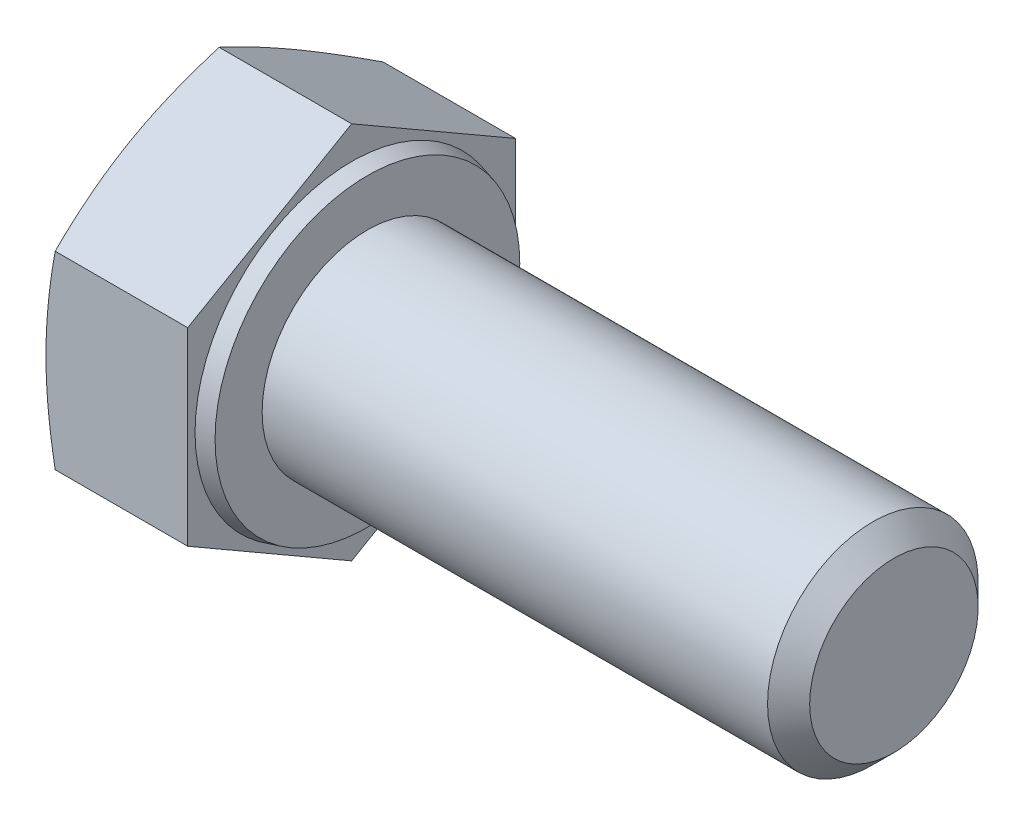
ISO-10303-21;
HEADER;
FILE_DESCRIPTION(('STEP AP214'),'2;1');
FILE_NAME('part.step','',(''),(''),'','','');
FILE_SCHEMA(('AUTOMOTIVE_DESIGN { 1 0 10303 214 1 1 1 1 }'));
ENDSEC;
DATA;
#1=APPLICATION_CONTEXT('core data for automotive mechanical design processes');
#2=APPLICATION_PROTOCOL_DEFINITION('international standard','automotive_design',2000,#1);
#3=PRODUCT_CONTEXT('',#1,'mechanical');
#4=PRODUCT('Part','Part','',(#3));
#5=PRODUCT_RELATED_PRODUCT_CATEGORY('part','',(#4));
#6=PRODUCT_DEFINITION_FORMATION('','',#4);
#7=PRODUCT_DEFINITION_CONTEXT('part definition',#1,'design');
#8=PRODUCT_DEFINITION('design','',#6,#7);
#9=PRODUCT_DEFINITION_SHAPE('','',#8);
#10=(LENGTH_UNIT() NAMED_UNIT(*) SI_UNIT(.MILLI.,.METRE.));
#11=(NAMED_UNIT(*) PLANE_ANGLE_UNIT() SI_UNIT($,.RADIAN.));
#12=(NAMED_UNIT(*) SI_UNIT($,.STERADIAN.) SOLID_ANGLE_UNIT());
#13=UNCERTAINTY_MEASURE_WITH_UNIT(LENGTH_MEASURE(1.E-05),#10,'distance_accuracy_value','');
#14=(GEOMETRIC_REPRESENTATION_CONTEXT(3) GLOBAL_UNCERTAINTY_ASSIGNED_CONTEXT((#13)) GLOBAL_UNIT_ASSIGNED_CONTEXT((#10,
#11,#12)) REPRESENTATION_CONTEXT('',''));
#15=CARTESIAN_POINT('',(0.,0.,0.));
#16=DIRECTION('',(0.,0.,1.));
#17=DIRECTION('',(1.,0.,0.));
#18=AXIS2_PLACEMENT_3D('',#15,#16,#17);
#19=CARTESIAN_POINT('',(20.6,-3.595,-6.22672265321011));
#20=DIRECTION('',(0.,-0.866025403784439,-0.5));
#21=DIRECTION('',(0.,0.5,-0.866025403784439));
#22=AXIS2_PLACEMENT_3D('',#19,#20,#21);
#23=PLANE('',#22);
#24=DIRECTION('',(-1.,0.,0.));
#25=VECTOR('',#24,1.);
#26=CARTESIAN_POINT('',(20.6,-7.19,0.));
#27=LINE('',#26,#25);
#28=CARTESIAN_POINT('',(0.,-7.19,0.));
#29=VERTEX_POINT('',#28);
#30=CARTESIAN_POINT('',(-5.03389102967511,-7.19,0.));
#31=VERTEX_POINT('',#30);
#32=EDGE_CURVE('E58',#29,#31,#27,.T.);
#33=ORIENTED_EDGE('',*,*,#32,.T.);
#34=CARTESIAN_POINT('',(-5.03384900100014,-7.19011547005384,0.0002));
#35=CARTESIAN_POINT('',(-5.08805963076519,-7.04122910407722,-0.257678750425791));
#36=CARTESIAN_POINT('',(-5.13737359308155,-6.89185177286806,-0.516407877579102));
#37=CARTESIAN_POINT('',(-5.22413389520894,-6.59212583670845,-1.0355484273537));
#38=CARTESIAN_POINT('',(-5.26157094835133,-6.44177656505055,-1.29596100474615));
#39=CARTESIAN_POINT('',(-5.32212431475841,-6.14177529234696,-1.81557845140411));
#40=CARTESIAN_POINT('',(-5.34537270513493,-5.99213014273963,-2.07477145363024));
#41=CARTESIAN_POINT('',(-5.37655533214507,-5.69248989384581,-2.59376358870692));
#42=CARTESIAN_POINT('',(-5.38449531124956,-5.54249494692291,-2.85356245765599));
#43=CARTESIAN_POINT('',(-5.38449531124956,-5.2425050530771,-3.37316019555412));
#44=CARTESIAN_POINT('',(-5.37655533214507,-5.09251010615419,-3.63295906450319));
#45=CARTESIAN_POINT('',(-5.34537270513493,-4.79286985726037,-4.15195119957987));
#46=CARTESIAN_POINT('',(-5.32212431475841,-4.64322470765305,-4.41114420180601));
#47=CARTESIAN_POINT('',(-5.26157094835133,-4.34322343494945,-4.93076164846397));
#48=CARTESIAN_POINT('',(-5.22413389520894,-4.19287416329156,-5.19117422585641));
#49=CARTESIAN_POINT('',(-5.13737359308155,-3.89314822713194,-5.71031477563101));
#50=CARTESIAN_POINT('',(-5.08805963076518,-3.74377089592278,-5.96904390278432));
#51=CARTESIAN_POINT('',(-5.03384900100014,-3.59488452994616,-6.22692265321011));
#52=B_SPLINE_CURVE_WITH_KNOTS('',3,(#34,#35,#36,#37,#38,#39,#40,#41,#42,#43,#44,#45,#46,#47,#48,
#49,#50,#51),.UNSPECIFIED.,.F.,.F.,(4,2,2,2,2,2,2,2,4),(0.,0.908095057252449,1.81689842260343,
2.71710763162562,3.61697908961632,4.51685054760702,5.41705975662921,6.32586312198019,
7.23395817923264),.UNSPECIFIED.);
#53=CARTESIAN_POINT('',(-5.03389102967511,-3.595,-6.22672265321011));
#54=VERTEX_POINT('',#53);
#55=EDGE_CURVE('E51',#31,#54,#52,.T.);
#56=ORIENTED_EDGE('',*,*,#55,.T.);
#57=DIRECTION('',(-1.,0.,0.));
#58=VECTOR('',#57,1.);
#59=CARTESIAN_POINT('',(20.6,-3.595,-6.22672265321011));
#60=LINE('',#59,#58);
#61=CARTESIAN_POINT('',(0.,-3.595,-6.22672265321011));
#62=VERTEX_POINT('',#61);
#63=EDGE_CURVE('E124',#62,#54,#60,.T.);
#64=ORIENTED_EDGE('',*,*,#63,.F.);
#65=DIRECTION('',(0.,-0.5,0.866025403784439));
#66=VECTOR('',#65,1.);
#67=CARTESIAN_POINT('',(0.,-3.595,-6.22672265321011));
#68=LINE('',#67,#66);
#69=EDGE_CURVE('E139',#62,#29,#68,.T.);
#70=ORIENTED_EDGE('',*,*,#69,.T.);
#71=EDGE_LOOP('',(#33,#56,#64,#70));
#72=FACE_BOUND('',#71,.T.);
#73=ADVANCED_FACE('F36',(#72),#23,.T.);
#74=CARTESIAN_POINT('',(20.6,3.595,-6.22672265321011));
#75=DIRECTION('',(0.,0.,-1.));
#76=DIRECTION('',(0.,1.,0.));
#77=AXIS2_PLACEMENT_3D('',#74,#75,#76);
#78=PLANE('',#77);
#79=ORIENTED_EDGE('',*,*,#63,.T.);
#80=CARTESIAN_POINT('',(-3.51290350463359,-9.51206244699165,-6.22672265321012));
#81=CARTESIAN_POINT('',(-3.59865067374366,-9.23040678020694,-6.22672265321012));
#82=CARTESIAN_POINT('',(-3.68339590180722,-8.948440403835,-6.22672265321012));
#83=CARTESIAN_POINT('',(-3.85032818164455,-8.38372806074036,-6.22672265321012));
#84=CARTESIAN_POINT('',(-3.93251503051058,-8.10098203410892,-6.22672265321012));
#85=CARTESIAN_POINT('',(-4.09391336009,-7.53406688733044,-6.22672265321012));
#86=CARTESIAN_POINT('',(-4.17311898619305,-7.24989609436889,-6.22672265321012));
#87=CARTESIAN_POINT('',(-4.32762595897665,-6.68049654285568,-6.22672265321012));
#88=CARTESIAN_POINT('',(-4.40292737592697,-6.39526780344452,-6.22672265321012));
#89=CARTESIAN_POINT('',(-4.54775778410175,-5.82709836820566,-6.22672265321012));
#90=CARTESIAN_POINT('',(-4.61734665667,-5.54417301266554,-6.22672265321011));
#91=CARTESIAN_POINT('',(-4.75059032929027,-4.97691372635876,-6.22672265321011));
#92=CARTESIAN_POINT('',(-4.81424502941142,-4.69257977195632,-6.22672265321011));
#93=CARTESIAN_POINT('',(-4.93413428437026,-4.12244081187139,-6.22672265321011));
#94=CARTESIAN_POINT('',(-4.99037139100831,-3.83663634741487,-6.22672265321011));
#95=CARTESIAN_POINT('',(-5.09371134025047,-3.26336845733878,-6.22672265321011));
#96=CARTESIAN_POINT('',(-5.14081448967723,-2.97590508777835,-6.22672265321011));
#97=CARTESIAN_POINT('',(-5.21930699352353,-2.43170060088507,-6.22672265321011));
#98=CARTESIAN_POINT('',(-5.2518662377399,-2.17512980718482,-6.22672265321011));
#99=CARTESIAN_POINT('',(-5.30696049565407,-1.66090521643882,-6.22672265321011));
#100=CARTESIAN_POINT('',(-5.32949580170818,-1.4032514512001,-6.22672265321011));
#101=CARTESIAN_POINT('',(-5.36345683516162,-0.887383641140857,-6.22672265321011));
#102=CARTESIAN_POINT('',(-5.37489039669814,-0.629170120469072,-6.22672265321011));
#103=CARTESIAN_POINT('',(-5.38606924306082,-0.112487483798661,-6.22672265321011));
#104=CARTESIAN_POINT('',(-5.38581460886695,0.145981630416715,-6.22672265321011));
#105=CARTESIAN_POINT('',(-5.37359991738923,0.663954843197887,-6.22672265321011));
#106=CARTESIAN_POINT('',(-5.36158028737254,0.923457513564079,-6.22672265321011));
#107=CARTESIAN_POINT('',(-5.32638854200036,1.44169898088408,-6.22672265321011));
#108=CARTESIAN_POINT('',(-5.30321615879705,1.70043775934188,-6.22672265321011));
#109=CARTESIAN_POINT('',(-5.24680158753448,2.21702436160621,-6.22672265321011));
#110=CARTESIAN_POINT('',(-5.21355075970606,2.47487122824474,-6.22672265321011));
#111=CARTESIAN_POINT('',(-5.1383262138086,2.98927496857798,-6.22672265321011));
#112=CARTESIAN_POINT('',(-5.09635245030345,3.24583183554621,-6.22672265321011));
#113=CARTESIAN_POINT('',(-5.00254996252867,3.77161154258582,-6.22672265321011));
#114=CARTESIAN_POINT('',(-4.95030790362126,4.0407599866922,-6.22672265321011));
#115=CARTESIAN_POINT('',(-4.83910100557231,4.57767329922066,-6.22672265321011));
#116=CARTESIAN_POINT('',(-4.78013565803658,4.84543806141054,-6.22672265321011));
#117=CARTESIAN_POINT('',(-4.65672193019494,5.37977561536939,-6.22672265321011));
#118=CARTESIAN_POINT('',(-4.59227195307975,5.64634803605647,-6.22672265321011));
#119=CARTESIAN_POINT('',(-4.45893792515359,6.17836938091286,-6.22672265321011));
#120=CARTESIAN_POINT('',(-4.39005398100717,6.44381833194503,-6.22672265321011));
#121=CARTESIAN_POINT('',(-4.24859250088054,6.97409102138935,-6.22672265321011));
#122=CARTESIAN_POINT('',(-4.17601034700023,7.2389135235188,-6.22672265321011));
#123=CARTESIAN_POINT('',(-4.02789200488949,7.76773266668567,-6.22672265321011));
#124=CARTESIAN_POINT('',(-3.95235577317997,8.0317292955058,-6.22672265321011));
#125=CARTESIAN_POINT('',(-3.7221641328738,8.82257156289593,-6.22672265321011));
#126=CARTESIAN_POINT('',(-3.56389961609156,9.3483659936652,-6.22672265321011));
#127=CARTESIAN_POINT('',(-3.24257396471912,10.3920660350929,-6.22672265321011));
#128=CARTESIAN_POINT('',(-3.07958583733744,10.9099943074093,-6.22672265321011));
#129=CARTESIAN_POINT('',(-2.74898726190027,11.9443978872245,-6.22672265321011));
#130=CARTESIAN_POINT('',(-2.5813765914879,12.4608731235069,-6.22672265321011));
#131=CARTESIAN_POINT('',(-2.24342037080104,13.4907541310804,-6.22672265321011));
#132=CARTESIAN_POINT('',(-2.07308761745729,14.0041641118251,-6.22672265321011));
#133=CARTESIAN_POINT('',(-1.81570195648708,14.77362367697,-6.22672265321011));
#134=CARTESIAN_POINT('',(-1.7295958228759,15.0299906446384,-6.22672265321011));
#135=CARTESIAN_POINT('',(-1.55682750223247,15.5425364828865,-6.22672265321011));
#136=CARTESIAN_POINT('',(-1.47016531655149,15.7987153539217,-6.22672265321011));
#137=CARTESIAN_POINT('',(-1.38326239219643,16.0548125224615,-6.22672265321011));
#138=B_SPLINE_CURVE_WITH_KNOTS('',3,(#80,#81,#82,#83,#84,#85,#86,#87,#88,#89,#90,#91,#92,#93,
#94,#95,#96,#97,#98,#99,#100,#101,#102,#103,#104,#105,#106,#107,#108,#109,#110,#111,#112,#113,
#114,#115,#116,#117,#118,#119,#120,#121,#122,#123,#124,#125,#126,#127,#128,#129,#130,#131,#132,
#133,#134,#135,#136,#137),.UNSPECIFIED.,.F.,.F.,(4,2,2,2,2,2,2,2,2,2,2,2,2,2,2,2,2,2,2,2,2,2,2,
2,2,2,2,2,4),(0.,0.883262987783514,1.76659585051986,2.65158142631617,3.53655106819753,
4.41057390114665,5.28461144989435,6.15834752361641,7.03205424221161,7.80776909780132,
8.58346132755328,9.35860577805133,10.1337448580756,10.9128293116603,11.6919324769004,
12.4717054281399,13.2514824411686,14.0738921575776,14.8963641033477,15.7190763303775,
16.5417687734372,17.3655149556542,18.1892732666067,19.8364902464891,21.4653706257557,
23.094329495726,24.7171047884872,25.5284270364797,26.3397473136057),.UNSPECIFIED.);
#139=CARTESIAN_POINT('',(-5.03389102967511,3.595,-6.22672265321011));
#140=VERTEX_POINT('',#139);
#141=EDGE_CURVE('E180',#54,#140,#138,.T.);
#142=ORIENTED_EDGE('',*,*,#141,.T.);
#143=DIRECTION('',(-1.,0.,0.));
#144=VECTOR('',#143,1.);
#145=CARTESIAN_POINT('',(20.6,3.595,-6.22672265321011));
#146=LINE('',#145,#144);
#147=CARTESIAN_POINT('',(0.,3.595,-6.22672265321011));
#148=VERTEX_POINT('',#147);
#149=EDGE_CURVE('E114',#148,#140,#146,.T.);
#150=ORIENTED_EDGE('',*,*,#149,.F.);
#151=DIRECTION('',(0.,-1.,0.));
#152=VECTOR('',#151,1.);
#153=CARTESIAN_POINT('',(0.,7.19,-6.22672265321011));
#154=LINE('',#153,#152);
#155=EDGE_CURVE('E137',#148,#62,#154,.T.);
#156=ORIENTED_EDGE('',*,*,#155,.T.);
#157=EDGE_LOOP('',(#79,#142,#150,#156));
#158=FACE_BOUND('',#157,.T.);
#159=ADVANCED_FACE('F155',(#158),#78,.T.);
#160=CARTESIAN_POINT('',(20.6,7.19,0.));
#161=DIRECTION('',(0.,0.866025403784438,-0.5));
#162=DIRECTION('',(0.,0.5,0.866025403784439));
#163=AXIS2_PLACEMENT_3D('',#160,#161,#162);
#164=PLANE('',#163);
#165=ORIENTED_EDGE('',*,*,#149,.T.);
#166=CARTESIAN_POINT('',(-5.03384900100014,3.59488452994616,-6.22692265321011));
#167=CARTESIAN_POINT('',(-5.08805963076519,3.74377089592278,-5.96904390278432));
#168=CARTESIAN_POINT('',(-5.13737359308155,3.89314822713194,-5.71031477563101));
#169=CARTESIAN_POINT('',(-5.22413389520894,4.19287416329156,-5.19117422585641));
#170=CARTESIAN_POINT('',(-5.26157094835133,4.34322343494945,-4.93076164846397));
#171=CARTESIAN_POINT('',(-5.32212431475841,4.64322470765305,-4.41114420180601));
#172=CARTESIAN_POINT('',(-5.34537270513493,4.79286985726037,-4.15195119957987));
#173=CARTESIAN_POINT('',(-5.37655533214507,5.09251010615419,-3.63295906450319));
#174=CARTESIAN_POINT('',(-5.38449531124956,5.2425050530771,-3.37316019555412));
#175=CARTESIAN_POINT('',(-5.38449531124956,5.54249494692291,-2.85356245765599));
#176=CARTESIAN_POINT('',(-5.37655533214507,5.69248989384581,-2.59376358870692));
#177=CARTESIAN_POINT('',(-5.34537270513493,5.99213014273963,-2.07477145363024));
#178=CARTESIAN_POINT('',(-5.32212431475841,6.14177529234696,-1.81557845140411));
#179=CARTESIAN_POINT('',(-5.26157094835133,6.44177656505056,-1.29596100474615));
#180=CARTESIAN_POINT('',(-5.22413389520894,6.59212583670845,-1.0355484273537));
#181=CARTESIAN_POINT('',(-5.13737359308155,6.89185177286806,-0.516407877579103));
#182=CARTESIAN_POINT('',(-5.08805963076518,7.04122910407722,-0.257678750425792));
#183=CARTESIAN_POINT('',(-5.03384900100014,7.19011547005384,0.000199999999999125));
#184=B_SPLINE_CURVE_WITH_KNOTS('',3,(#166,#167,#168,#169,#170,#171,#172,#173,#174,#175,#176,
#177,#178,#179,#180,#181,#182,#183),.UNSPECIFIED.,.F.,.F.,(4,2,2,2,2,2,2,2,4),(0.,
0.908095057252449,1.81689842260343,2.71710763162562,3.61697908961632,4.51685054760702,
5.41705975662921,6.32586312198019,7.23395817923264),.UNSPECIFIED.);
#185=CARTESIAN_POINT('',(-5.03389102967511,7.19,0.));
#186=VERTEX_POINT('',#185);
#187=EDGE_CURVE('E107',#140,#186,#184,.T.);
#188=ORIENTED_EDGE('',*,*,#187,.T.);
#189=DIRECTION('',(-1.,0.,0.));
#190=VECTOR('',#189,1.);
#191=CARTESIAN_POINT('',(20.6,7.19,0.));
#192=LINE('',#191,#190);
#193=CARTESIAN_POINT('',(0.,7.19,0.));
#194=VERTEX_POINT('',#193);
#195=EDGE_CURVE('E106',#194,#186,#192,.T.);
#196=ORIENTED_EDGE('',*,*,#195,.F.);
#197=DIRECTION('',(0.,-0.5,-0.866025403784439));
#198=VECTOR('',#197,1.);
#199=CARTESIAN_POINT('',(0.,7.19,0.));
#200=LINE('',#199,#198);
#201=EDGE_CURVE('E135',#194,#148,#200,.T.);
#202=ORIENTED_EDGE('',*,*,#201,.T.);
#203=EDGE_LOOP('',(#165,#188,#196,#202));
#204=FACE_BOUND('',#203,.T.);
#205=ADVANCED_FACE('F161',(#204),#164,.T.);
#206=CARTESIAN_POINT('',(20.6,3.595,6.22672265321012));
#207=DIRECTION('',(0.,0.866025403784439,0.5));
#208=DIRECTION('',(0.,-0.5,0.866025403784439));
#209=AXIS2_PLACEMENT_3D('',#206,#207,#208);
#210=PLANE('',#209);
#211=ORIENTED_EDGE('',*,*,#195,.T.);
#212=CARTESIAN_POINT('',(-5.03384900100014,7.19011547005384,-0.000200000000000765));
#213=CARTESIAN_POINT('',(-5.08805963076518,7.04122910407722,0.25767875042579));
#214=CARTESIAN_POINT('',(-5.13737359308155,6.89185177286806,0.516407877579101));
#215=CARTESIAN_POINT('',(-5.22413389520894,6.59212583670845,1.0355484273537));
#216=CARTESIAN_POINT('',(-5.26157094835133,6.44177656505056,1.29596100474615));
#217=CARTESIAN_POINT('',(-5.32212431475841,6.14177529234696,1.81557845140411));
#218=CARTESIAN_POINT('',(-5.34537270513493,5.99213014273963,2.07477145363024));
#219=CARTESIAN_POINT('',(-5.37655533214507,5.69248989384581,2.59376358870692));
#220=CARTESIAN_POINT('',(-5.38449531124956,5.54249494692291,2.85356245765599));
#221=CARTESIAN_POINT('',(-5.38449531124956,5.2425050530771,3.37316019555412));
#222=CARTESIAN_POINT('',(-5.37655533214507,5.09251010615419,3.63295906450319));
#223=CARTESIAN_POINT('',(-5.34537270513493,4.79286985726037,4.15195119957987));
#224=CARTESIAN_POINT('',(-5.32212431475841,4.64322470765305,4.41114420180601));
#225=CARTESIAN_POINT('',(-5.26157094835133,4.34322343494945,4.93076164846397));
#226=CARTESIAN_POINT('',(-5.22413389520894,4.19287416329156,5.19117422585641));
#227=CARTESIAN_POINT('',(-5.13737359308155,3.89314822713194,5.71031477563101));
#228=CARTESIAN_POINT('',(-5.08805963076518,3.74377089592278,5.96904390278432));
#229=CARTESIAN_POINT('',(-5.03384900100014,3.59488452994616,6.22692265321012));
#230=B_SPLINE_CURVE_WITH_KNOTS('',3,(#212,#213,#214,#215,#216,#217,#218,#219,#220,#221,#222,
#223,#224,#225,#226,#227,#228,#229),.UNSPECIFIED.,.F.,.F.,(4,2,2,2,2,2,2,2,4),(0.,
0.908095057252449,1.81689842260343,2.71710763162562,3.61697908961632,4.51685054760702,
5.41705975662921,6.32586312198019,7.23395817923264),.UNSPECIFIED.);
#231=CARTESIAN_POINT('',(-5.03389102967511,3.595,6.22672265321012));
#232=VERTEX_POINT('',#231);
#233=EDGE_CURVE('E91',#186,#232,#230,.T.);
#234=ORIENTED_EDGE('',*,*,#233,.T.);
#235=DIRECTION('',(-1.,0.,0.));
#236=VECTOR('',#235,1.);
#237=CARTESIAN_POINT('',(20.6,3.595,6.22672265321012));
#238=LINE('',#237,#236);
#239=CARTESIAN_POINT('',(0.,3.595,6.22672265321012));
#240=VERTEX_POINT('',#239);
#241=EDGE_CURVE('E103',#240,#232,#238,.T.);
#242=ORIENTED_EDGE('',*,*,#241,.F.);
#243=DIRECTION('',(0.,0.5,-0.866025403784439));
#244=VECTOR('',#243,1.);
#245=CARTESIAN_POINT('',(0.,7.19,0.));
#246=LINE('',#245,#244);
#247=EDGE_CURVE('E133',#240,#194,#246,.T.);
#248=ORIENTED_EDGE('',*,*,#247,.T.);
#249=EDGE_LOOP('',(#211,#234,#242,#248));
#250=FACE_BOUND('',#249,.T.);
#251=ADVANCED_FACE('F102',(#250),#210,.T.);
#252=CARTESIAN_POINT('',(20.6,-3.595,6.22672265321012));
#253=DIRECTION('',(0.,0.,1.));
#254=DIRECTION('',(1.,0.,0.));
#255=AXIS2_PLACEMENT_3D('',#252,#253,#254);
#256=PLANE('',#255);
#257=ORIENTED_EDGE('',*,*,#241,.T.);
#258=CARTESIAN_POINT('',(-3.51290508611603,-9.51205725371464,6.22672265321012));
#259=CARTESIAN_POINT('',(-3.59865217996763,-9.2304017880567,6.22672265321012));
#260=CARTESIAN_POINT('',(-3.68339733297397,-8.94843561292577,6.22672265321012));
#261=CARTESIAN_POINT('',(-3.85032946359841,-8.38372367274364,6.22672265321012));
#262=CARTESIAN_POINT('',(-3.93251623830892,-8.10097784778373,6.22672265321012));
#263=CARTESIAN_POINT('',(-4.09391442059783,-7.53406310622304,6.22672265321012));
#264=CARTESIAN_POINT('',(-4.17311997357866,-7.24989251681173,6.22672265321012));
#265=CARTESIAN_POINT('',(-4.32762680242183,-6.68049337324663,6.22672265321012));
#266=CARTESIAN_POINT('',(-4.40292814855382,-6.3952648382333,6.22672265321012));
#267=CARTESIAN_POINT('',(-4.54775841953013,-5.82709581042908,6.22672265321012));
#268=CARTESIAN_POINT('',(-4.61734722567375,-5.54417065791081,6.22672265321012));
#269=CARTESIAN_POINT('',(-4.75059077074392,-4.97691177927585,6.22672265321012));
#270=CARTESIAN_POINT('',(-4.81424540974025,-4.69257802952355,6.22672265321012));
#271=CARTESIAN_POINT('',(-4.93413455045104,-4.12243948030663,6.22672265321012));
#272=CARTESIAN_POINT('',(-4.99037160395253,-3.83663522206503,6.22672265321012));
#273=CARTESIAN_POINT('',(-5.09371145826456,-3.26336774677179,6.22672265321012));
#274=CARTESIAN_POINT('',(-5.14081456589485,-2.97590458577873,6.22672265321012));
#275=CARTESIAN_POINT('',(-5.21930703944179,-2.43170025907276,6.22672265321012));
#276=CARTESIAN_POINT('',(-5.25186628549319,-2.17512941557449,6.22672265321012));
#277=CARTESIAN_POINT('',(-5.30696054251941,-1.66090472496614,6.22672265321012));
#278=CARTESIAN_POINT('',(-5.32949584585066,-1.40325090966308,6.22672265321012));
#279=CARTESIAN_POINT('',(-5.36345686891723,-0.88738299958265,6.22672265321012));
#280=CARTESIAN_POINT('',(-5.37489042279491,-0.62916942895409,6.22672265321012));
#281=CARTESIAN_POINT('',(-5.38606924904272,-0.112486692775754,6.22672265321012));
#282=CARTESIAN_POINT('',(-5.38581460239283,0.145982470990777,6.22672265321012));
#283=CARTESIAN_POINT('',(-5.37359988177924,0.663955784214362,6.22672265321012));
#284=CARTESIAN_POINT('',(-5.36158023497983,0.923458505466206,6.22672265321012));
#285=CARTESIAN_POINT('',(-5.3263884528181,1.44170007368661,6.22672265321012));
#286=CARTESIAN_POINT('',(-5.30321604960751,1.7004389021591,6.22672265321012));
#287=CARTESIAN_POINT('',(-5.24680143623883,2.21702560380556,6.22672265321012));
#288=CARTESIAN_POINT('',(-5.21355058630372,2.47487251981011,6.22672265321012));
#289=CARTESIAN_POINT('',(-5.13832599511556,2.98927635818654,6.22672265321012));
#290=CARTESIAN_POINT('',(-5.09635220842638,3.24583327383193,6.22672265321012));
#291=CARTESIAN_POINT('',(-5.00254968168844,3.77161302966225,6.22672265321012));
#292=CARTESIAN_POINT('',(-4.95030760851958,4.04076147413116,6.22672265321012));
#293=CARTESIAN_POINT('',(-4.83910068432238,4.57767478754593,6.22672265321012));
#294=CARTESIAN_POINT('',(-4.7801353249004,4.8454395502597,6.22672265321012));
#295=CARTESIAN_POINT('',(-4.65672157529754,5.37977710544744,6.22672265321012));
#296=CARTESIAN_POINT('',(-4.59227158830931,5.64634952683991,6.22672265321012));
#297=CARTESIAN_POINT('',(-4.45893754227179,6.17837087337752,6.22672265321012));
#298=CARTESIAN_POINT('',(-4.39005358988696,6.4438198253855,6.22672265321012));
#299=CARTESIAN_POINT('',(-4.24859209472407,6.97409251652315,6.22672265321012));
#300=CARTESIAN_POINT('',(-4.17600993405459,7.2389150193723,6.22672265321012));
#301=CARTESIAN_POINT('',(-4.02789157942869,7.76773416420793,6.22672265321012));
#302=CARTESIAN_POINT('',(-3.95235534199323,8.03173079397712,6.22672265321012));
#303=CARTESIAN_POINT('',(-3.72216368574898,8.8225730645819,6.22672265321012));
#304=CARTESIAN_POINT('',(-3.5638991600107,9.34836749791472,6.22672265321012));
#305=CARTESIAN_POINT('',(-3.2425734978752,10.3920675289828,6.22672265321012));
#306=CARTESIAN_POINT('',(-3.07958536886221,10.9099957884314,6.22672265321012));
#307=CARTESIAN_POINT('',(-2.74898679178007,11.9443993429674,6.22672265321012));
#308=CARTESIAN_POINT('',(-2.58137612135426,12.4608745668382,6.22672265321012));
#309=CARTESIAN_POINT('',(-2.24341990106824,13.4907555519379,6.22672265321012));
#310=CARTESIAN_POINT('',(-2.07308714812183,14.0041655226146,6.22672265321012));
#311=CARTESIAN_POINT('',(-1.81570148828254,14.7736250728444,6.22672265321012));
#312=CARTESIAN_POINT('',(-1.72959535513498,15.0299920355796,6.22672265321012));
#313=CARTESIAN_POINT('',(-1.55682703557139,15.542537864011,6.22672265321012));
#314=CARTESIAN_POINT('',(-1.47016485050663,15.7987167301625,6.22672265321012));
#315=CARTESIAN_POINT('',(-1.38326192683059,16.0548138938391,6.22672265321012));
#316=B_SPLINE_CURVE_WITH_KNOTS('',3,(#258,#259,#260,#261,#262,#263,#264,#265,#266,#267,#268,
#269,#270,#271,#272,#273,#274,#275,#276,#277,#278,#279,#280,#281,#282,#283,#284,#285,#286,#287,
#288,#289,#290,#291,#292,#293,#294,#295,#296,#297,#298,#299,#300,#301,#302,#303,#304,#305,#306,
#307,#308,#309,#310,#311,#312,#313,#314,#315),.UNSPECIFIED.,.F.,.F.,(4,2,2,2,2,2,2,2,2,2,2,2,2,
2,2,2,2,2,2,2,2,2,2,2,2,2,2,2,4),(0.,0.883262344799887,1.76659456447282,2.6515794931495,
3.53654848794066,4.41057068190114,5.28460759156824,6.15834302768208,7.03204910893083,
7.80776411328184,8.58345649179181,9.35860109082504,10.1337403193849,10.9128249276724,
11.6919282476459,12.471701354226,13.2514785225995,14.0738882483056,14.8963602033275,
15.7190724394093,16.5417648915329,17.365511081231,18.1892693996557,19.8364863946962,
21.4653667386268,23.0943255732039,24.7171008369271,25.5284230704479,26.3397433331034),.UNSPECIFIED.);
#317=CARTESIAN_POINT('',(-5.03389102967511,-3.595,6.22672265321011));
#318=VERTEX_POINT('',#317);
#319=EDGE_CURVE('E87',#232,#318,#316,.F.);
#320=ORIENTED_EDGE('',*,*,#319,.T.);
#321=DIRECTION('',(-1.,0.,0.));
#322=VECTOR('',#321,1.);
#323=CARTESIAN_POINT('',(20.6,-3.595,6.22672265321012));
#324=LINE('',#323,#322);
#325=CARTESIAN_POINT('',(0.,-3.595,6.22672265321012));
#326=VERTEX_POINT('',#325);
#327=EDGE_CURVE('E112',#326,#318,#324,.T.);
#328=ORIENTED_EDGE('',*,*,#327,.F.);
#329=DIRECTION('',(0.,1.,0.));
#330=VECTOR('',#329,1.);
#331=CARTESIAN_POINT('',(0.,7.19,6.22672265321012));
#332=LINE('',#331,#330);
#333=EDGE_CURVE('E111',#326,#240,#332,.T.);
#334=ORIENTED_EDGE('',*,*,#333,.T.);
#335=EDGE_LOOP('',(#257,#320,#328,#334));
#336=FACE_BOUND('',#335,.T.);
#337=ADVANCED_FACE('F109',(#336),#256,.T.);
#338=CARTESIAN_POINT('',(20.6,-7.19,0.));
#339=DIRECTION('',(0.,-0.866025403784439,0.5));
#340=DIRECTION('',(0.,-0.5,-0.866025403784439));
#341=AXIS2_PLACEMENT_3D('',#338,#339,#340);
#342=PLANE('',#341);
#343=ORIENTED_EDGE('',*,*,#327,.T.);
#344=CARTESIAN_POINT('',(-5.03384900100014,-3.59488452994616,6.22692265321012));
#345=CARTESIAN_POINT('',(-5.08805963076519,-3.74377089592278,5.96904390278433));
#346=CARTESIAN_POINT('',(-5.13737359308155,-3.89314822713194,5.71031477563101));
#347=CARTESIAN_POINT('',(-5.22413389520894,-4.19287416329155,5.19117422585641));
#348=CARTESIAN_POINT('',(-5.26157094835133,-4.34322343494944,4.93076164846397));
#349=CARTESIAN_POINT('',(-5.32212431475841,-4.64322470765304,4.41114420180601));
#350=CARTESIAN_POINT('',(-5.34537270513493,-4.79286985726037,4.15195119957987));
#351=CARTESIAN_POINT('',(-5.37655533214507,-5.09251010615419,3.63295906450319));
#352=CARTESIAN_POINT('',(-5.38449531124956,-5.2425050530771,3.37316019555413));
#353=CARTESIAN_POINT('',(-5.38449531124956,-5.5424949469229,2.85356245765599));
#354=CARTESIAN_POINT('',(-5.37655533214507,-5.69248989384581,2.59376358870692));
#355=CARTESIAN_POINT('',(-5.34537270513493,-5.99213014273963,2.07477145363024));
#356=CARTESIAN_POINT('',(-5.32212431475841,-6.14177529234696,1.81557845140411));
#357=CARTESIAN_POINT('',(-5.26157094835133,-6.44177656505055,1.29596100474615));
#358=CARTESIAN_POINT('',(-5.22413389520894,-6.59212583670844,1.0355484273537));
#359=CARTESIAN_POINT('',(-5.13737359308155,-6.89185177286806,0.516407877579102));
#360=CARTESIAN_POINT('',(-5.08805963076519,-7.04122910407722,0.257678750425791));
#361=CARTESIAN_POINT('',(-5.03384900100014,-7.19011547005384,-0.000199999999999902));
#362=B_SPLINE_CURVE_WITH_KNOTS('',3,(#344,#345,#346,#347,#348,#349,#350,#351,#352,#353,#354,
#355,#356,#357,#358,#359,#360,#361),.UNSPECIFIED.,.F.,.F.,(4,2,2,2,2,2,2,2,4),(0.,
0.908095057252449,1.81689842260343,2.71710763162562,3.61697908961632,4.51685054760702,
5.41705975662921,6.32586312198019,7.23395817923264),.UNSPECIFIED.);
#363=EDGE_CURVE('E93',#318,#31,#362,.T.);
#364=ORIENTED_EDGE('',*,*,#363,.T.);
#365=ORIENTED_EDGE('',*,*,#32,.F.);
#366=DIRECTION('',(0.,0.5,0.866025403784439));
#367=VECTOR('',#366,1.);
#368=CARTESIAN_POINT('',(0.,-3.595,6.22672265321011));
#369=LINE('',#368,#367);
#370=EDGE_CURVE('E130',#29,#326,#369,.T.);
#371=ORIENTED_EDGE('',*,*,#370,.T.);
#372=EDGE_LOOP('',(#343,#364,#365,#371));
#373=FACE_BOUND('',#372,.T.);
#374=ADVANCED_FACE('F167',(#373),#342,.T.);
#375=CARTESIAN_POINT('',(0.,7.19,0.));
#376=DIRECTION('',(-1.,0.,0.));
#377=DIRECTION('',(0.,0.,1.));
#378=AXIS2_PLACEMENT_3D('',#375,#376,#377);
#379=PLANE('',#378);
#380=CARTESIAN_POINT('',(0.,0.,0.));
#381=DIRECTION('',(-1.,0.,0.));
#382=DIRECTION('',(0.,0.,1.));
#383=AXIS2_PLACEMENT_3D('',#380,#381,#382);
#384=CIRCLE('',#383,5.94897459621555);
#385=CARTESIAN_POINT('',(0.,0.,5.94897459621555));
#386=VERTEX_POINT('',#385);
#387=EDGE_CURVE('E127',#386,#386,#384,.T.);
#388=ORIENTED_EDGE('',*,*,#387,.T.);
#389=EDGE_LOOP('',(#388));
#390=FACE_BOUND('',#389,.T.);
#391=ORIENTED_EDGE('',*,*,#69,.F.);
#392=ORIENTED_EDGE('',*,*,#155,.F.);
#393=ORIENTED_EDGE('',*,*,#201,.F.);
#394=ORIENTED_EDGE('',*,*,#247,.F.);
#395=ORIENTED_EDGE('',*,*,#333,.F.);
#396=ORIENTED_EDGE('',*,*,#370,.F.);
#397=EDGE_LOOP('',(#391,#392,#393,#394,#395,#396));
#398=FACE_BOUND('',#397,.T.);
#399=ADVANCED_FACE('F224',(#390,#398),#379,.F.);
#400=CARTESIAN_POINT('',(0.599999999999934,0.,0.));
#401=DIRECTION('',(-1.,0.,0.));
#402=DIRECTION('',(0.,0.,1.));
#403=AXIS2_PLACEMENT_3D('',#400,#401,#402);
#404=CONICAL_SURFACE('',#403,5.78820508075687,0.261799387799173);
#405=ORIENTED_EDGE('',*,*,#387,.F.);
#406=EDGE_LOOP('',(#405));
#407=FACE_BOUND('',#406,.T.);
#408=CARTESIAN_POINT('',(0.599999999999934,0.,0.));
#409=DIRECTION('',(-1.,0.,0.));
#410=DIRECTION('',(0.,0.,1.));
#411=AXIS2_PLACEMENT_3D('',#408,#409,#410);
#412=CIRCLE('',#411,5.78820508075687);
#413=CARTESIAN_POINT('',(0.599999999999934,0.,5.78820508075687));
#414=VERTEX_POINT('',#413);
#415=EDGE_CURVE('E123',#414,#414,#412,.T.);
#416=ORIENTED_EDGE('',*,*,#415,.T.);
#417=EDGE_LOOP('',(#416));
#418=FACE_BOUND('',#417,.T.);
#419=ADVANCED_FACE('F228',(#407,#418),#404,.T.);
#420=CARTESIAN_POINT('',(0.6,5.78820508075687,0.));
#421=DIRECTION('',(-1.,0.,0.));
#422=DIRECTION('',(0.,0.,1.));
#423=AXIS2_PLACEMENT_3D('',#420,#421,#422);
#424=PLANE('',#423);
#425=ORIENTED_EDGE('',*,*,#415,.F.);
#426=EDGE_LOOP('',(#425));
#427=FACE_BOUND('',#426,.T.);
#428=CARTESIAN_POINT('',(0.599999999999934,0.,0.));
#429=DIRECTION('',(-1.,0.,0.));
#430=DIRECTION('',(0.,0.,1.));
#431=AXIS2_PLACEMENT_3D('',#428,#429,#430);
#432=CIRCLE('',#431,4.);
#433=CARTESIAN_POINT('',(0.599999999999934,0.,4.));
#434=VERTEX_POINT('',#433);
#435=EDGE_CURVE('E120',#434,#434,#432,.T.);
#436=ORIENTED_EDGE('',*,*,#435,.T.);
#437=EDGE_LOOP('',(#436));
#438=FACE_BOUND('',#437,.T.);
#439=ADVANCED_FACE('F247',(#427,#438),#424,.F.);
#440=CARTESIAN_POINT('',(-1000.,0.,0.));
#441=DIRECTION('',(-1.,0.,0.));
#442=DIRECTION('',(0.,0.,1.));
#443=AXIS2_PLACEMENT_3D('',#440,#441,#442);
#444=CYLINDRICAL_SURFACE('',#443,4.);
#445=CARTESIAN_POINT('',(19.8,0.,0.));
#446=DIRECTION('',(-1.,0.,0.));
#447=DIRECTION('',(0.,0.,1.));
#448=AXIS2_PLACEMENT_3D('',#445,#446,#447);
#449=CIRCLE('',#448,4.);
#450=CARTESIAN_POINT('',(19.8,0.,4.));
#451=VERTEX_POINT('',#450);
#452=EDGE_CURVE('E44',#451,#451,#449,.T.);
#453=ORIENTED_EDGE('',*,*,#452,.T.);
#454=EDGE_LOOP('',(#453));
#455=FACE_BOUND('',#454,.T.);
#456=ORIENTED_EDGE('',*,*,#435,.F.);
#457=EDGE_LOOP('',(#456));
#458=FACE_BOUND('',#457,.T.);
#459=ADVANCED_FACE('F143',(#455,#458),#444,.T.);
#460=CARTESIAN_POINT('',(20.6,4.,0.));
#461=DIRECTION('',(-1.,0.,0.));
#462=DIRECTION('',(0.,0.,1.));
#463=AXIS2_PLACEMENT_3D('',#460,#461,#462);
#464=PLANE('',#463);
#465=CARTESIAN_POINT('',(20.6,0.,0.));
#466=DIRECTION('',(-1.,0.,0.));
#467=DIRECTION('',(0.,0.,1.));
#468=AXIS2_PLACEMENT_3D('',#465,#466,#467);
#469=CIRCLE('',#468,3.19999999999988);
#470=CARTESIAN_POINT('',(20.6,0.,3.19999999999987));
#471=VERTEX_POINT('',#470);
#472=EDGE_CURVE('E12',#471,#471,#469,.F.);
#473=ORIENTED_EDGE('',*,*,#472,.T.);
#474=EDGE_LOOP('',(#473));
#475=FACE_BOUND('',#474,.T.);
#476=ADVANCED_FACE('F170',(#475),#464,.F.);
#477=CARTESIAN_POINT('',(-5.44999999999995,0.,0.));
#478=DIRECTION('',(1.,0.,0.));
#479=DIRECTION('',(0.,0.,-1.));
#480=AXIS2_PLACEMENT_3D('',#477,#478,#479);
#481=CONICAL_SURFACE('',#480,6.04675,1.22173047639602);
#482=ORIENTED_EDGE('',*,*,#363,.F.);
#483=ORIENTED_EDGE('',*,*,#319,.F.);
#484=ORIENTED_EDGE('',*,*,#233,.F.);
#485=ORIENTED_EDGE('',*,*,#187,.F.);
#486=ORIENTED_EDGE('',*,*,#141,.F.);
#487=ORIENTED_EDGE('',*,*,#55,.F.);
#488=EDGE_LOOP('',(#482,#483,#484,#485,#486,#487));
#489=FACE_BOUND('',#488,.T.);
#490=CARTESIAN_POINT('',(-5.44999999999995,0.,0.));
#491=DIRECTION('',(-1.,0.,0.));
#492=DIRECTION('',(0.,0.,1.));
#493=AXIS2_PLACEMENT_3D('',#490,#491,#492);
#494=CIRCLE('',#493,6.04675);
#495=CARTESIAN_POINT('',(-5.44999999999995,0.,6.04675));
#496=VERTEX_POINT('',#495);
#497=EDGE_CURVE('E241',#496,#496,#494,.T.);
#498=ORIENTED_EDGE('',*,*,#497,.F.);
#499=EDGE_LOOP('',(#498));
#500=FACE_BOUND('',#499,.T.);
#501=ADVANCED_FACE('F89',(#489,#500),#481,.T.);
#502=CARTESIAN_POINT('',(-5.45,0.,0.));
#503=DIRECTION('',(1.,0.,0.));
#504=DIRECTION('',(0.,0.,-1.));
#505=AXIS2_PLACEMENT_3D('',#502,#503,#504);
#506=PLANE('',#505);
#507=ORIENTED_EDGE('',*,*,#497,.T.);
#508=EDGE_LOOP('',(#507));
#509=FACE_BOUND('',#508,.T.);
#510=ADVANCED_FACE('F147',(#509),#506,.F.);
#511=CARTESIAN_POINT('',(19.8,0.,0.));
#512=DIRECTION('',(-1.,0.,0.));
#513=DIRECTION('',(0.,0.,1.));
#514=AXIS2_PLACEMENT_3D('',#511,#512,#513);
#515=CONICAL_SURFACE('',#514,4.,0.78539816339755);
#516=CARTESIAN_POINT('',(20.6,0.,3.19999999999987));
#517=CARTESIAN_POINT('',(20.5916666666667,0.,3.20833333333321));
#518=CARTESIAN_POINT('',(20.5833333333333,0.,3.21666666666654));
#519=CARTESIAN_POINT('',(20.5666666666667,0.,3.23333333333321));
#520=CARTESIAN_POINT('',(20.5583333333333,0.,3.24166666666655));
#521=CARTESIAN_POINT('',(20.5416666666667,0.,3.25833333333322));
#522=CARTESIAN_POINT('',(20.5333333333333,0.,3.26666666666655));
#523=CARTESIAN_POINT('',(20.5166666666667,0.,3.28333333333322));
#524=CARTESIAN_POINT('',(20.5083333333333,0.,3.29166666666656));
#525=CARTESIAN_POINT('',(20.4916666666667,0.,3.30833333333322));
#526=CARTESIAN_POINT('',(20.4833333333333,0.,3.31666666666656));
#527=CARTESIAN_POINT('',(20.4666666666667,0.,3.33333333333323));
#528=CARTESIAN_POINT('',(20.4583333333333,0.,3.34166666666656));
#529=CARTESIAN_POINT('',(20.4416666666667,0.,3.35833333333323));
#530=CARTESIAN_POINT('',(20.4333333333333,0.,3.36666666666657));
#531=CARTESIAN_POINT('',(20.4166666666667,0.,3.38333333333324));
#532=CARTESIAN_POINT('',(20.4083333333333,0.,3.39166666666657));
#533=CARTESIAN_POINT('',(20.3916666666667,0.,3.40833333333324));
#534=CARTESIAN_POINT('',(20.3833333333333,0.,3.41666666666658));
#535=CARTESIAN_POINT('',(20.3666666666667,0.,3.43333333333324));
#536=CARTESIAN_POINT('',(20.3583333333333,0.,3.44166666666658));
#537=CARTESIAN_POINT('',(20.3416666666667,0.,3.45833333333325));
#538=CARTESIAN_POINT('',(20.3333333333333,0.,3.46666666666658));
#539=CARTESIAN_POINT('',(20.3166666666667,0.,3.48333333333325));
#540=CARTESIAN_POINT('',(20.3083333333333,0.,3.49166666666659));
#541=CARTESIAN_POINT('',(20.2916666666667,0.,3.50833333333326));
#542=CARTESIAN_POINT('',(20.2833333333334,0.,3.51666666666659));
#543=CARTESIAN_POINT('',(20.2666666666667,0.,3.53333333333326));
#544=CARTESIAN_POINT('',(20.2583333333334,0.,3.54166666666659));
#545=CARTESIAN_POINT('',(20.2416666666667,0.,3.55833333333326));
#546=CARTESIAN_POINT('',(20.2333333333334,0.,3.5666666666666));
#547=CARTESIAN_POINT('',(20.2166666666667,0.,3.58333333333327));
#548=CARTESIAN_POINT('',(20.2083333333334,0.,3.5916666666666));
#549=CARTESIAN_POINT('',(20.1916666666667,0.,3.60833333333327));
#550=CARTESIAN_POINT('',(20.1833333333334,0.,3.61666666666661));
#551=CARTESIAN_POINT('',(20.1666666666667,0.,3.63333333333327));
#552=CARTESIAN_POINT('',(20.1583333333334,0.,3.64166666666661));
#553=CARTESIAN_POINT('',(20.1416666666667,0.,3.65833333333328));
#554=CARTESIAN_POINT('',(20.1333333333334,0.,3.66666666666661));
#555=CARTESIAN_POINT('',(20.1166666666667,0.,3.68333333333328));
#556=CARTESIAN_POINT('',(20.1083333333334,0.,3.69166666666662));
#557=CARTESIAN_POINT('',(20.0916666666667,0.,3.70833333333329));
#558=CARTESIAN_POINT('',(20.0833333333334,0.,3.71666666666662));
#559=CARTESIAN_POINT('',(20.0666666666667,0.,3.73333333333329));
#560=CARTESIAN_POINT('',(20.0583333333334,0.,3.74166666666663));
#561=CARTESIAN_POINT('',(20.0416666666667,0.,3.75833333333329));
#562=CARTESIAN_POINT('',(20.0333333333334,0.,3.76666666666663));
#563=CARTESIAN_POINT('',(20.0166666666667,0.,3.7833333333333));
#564=CARTESIAN_POINT('',(20.0083333333334,0.,3.79166666666663));
#565=CARTESIAN_POINT('',(19.9916666666667,0.,3.8083333333333));
#566=CARTESIAN_POINT('',(19.9833333333334,0.,3.81666666666664));
#567=CARTESIAN_POINT('',(19.9666666666667,0.,3.83333333333331));
#568=CARTESIAN_POINT('',(19.9583333333334,0.,3.84166666666664));
#569=CARTESIAN_POINT('',(19.9416666666667,0.,3.85833333333331));
#570=CARTESIAN_POINT('',(19.9333333333334,0.,3.86666666666664));
#571=CARTESIAN_POINT('',(19.9166666666667,0.,3.88333333333331));
#572=CARTESIAN_POINT('',(19.9083333333334,0.,3.89166666666665));
#573=CARTESIAN_POINT('',(19.8916666666667,0.,3.90833333333332));
#574=CARTESIAN_POINT('',(19.8833333333334,0.,3.91666666666665));
#575=CARTESIAN_POINT('',(19.8666666666667,0.,3.93333333333332));
#576=CARTESIAN_POINT('',(19.8583333333334,0.,3.94166666666666));
#577=CARTESIAN_POINT('',(19.8416666666667,0.,3.95833333333333));
#578=CARTESIAN_POINT('',(19.8333333333334,0.,3.96666666666666));
#579=CARTESIAN_POINT('',(19.8166666666667,0.,3.98333333333333));
#580=CARTESIAN_POINT('',(19.8083333333334,0.,3.99166666666666));
#581=CARTESIAN_POINT('',(19.8,0.,4.));
#582=B_SPLINE_CURVE_WITH_KNOTS('',3,(#516,#517,#518,#519,#520,#521,#522,#523,#524,#525,#526,
#527,#528,#529,#530,#531,#532,#533,#534,#535,#536,#537,#538,#539,#540,#541,#542,#543,#544,#545,
#546,#547,#548,#549,#550,#551,#552,#553,#554,#555,#556,#557,#558,#559,#560,#561,#562,#563,#564,
#565,#566,#567,#568,#569,#570,#571,#572,#573,#574,#575,#576,#577,#578,#579,#580,#581),
.UNSPECIFIED.,.F.,.F.,(4,2,2,2,2,2,2,2,2,2,2,2,2,2,2,2,2,2,2,2,2,2,2,2,2,2,2,2,2,2,2,2,4),(0.,
0.0353553390593305,0.0707106781186589,0.106066017177989,0.141421356237318,0.176776695296648,
0.212132034355976,0.247487373415307,0.282842712474635,0.318198051533963,0.353553390593294,
0.388908729652622,0.424264068711953,0.459619407771281,0.494974746830611,0.53033008588994,
0.565685424949268,0.601040764008599,0.636396103067927,0.671751442127257,0.707106781186586,
0.742462120245916,0.777817459305244,0.813172798364575,0.848528137423903,0.883883476483231,
0.919238815542562,0.95459415460189,0.989949493661221,1.02530483272055,1.06066017177988,
1.09601551083921,1.13137084989854),.UNSPECIFIED.);
#583=EDGE_CURVE('BSEAM38',#471,#451,#582,.T.);
#584=ORIENTED_EDGE('',*,*,#472,.F.);
#585=ORIENTED_EDGE('',*,*,#452,.F.);
#586=ORIENTED_EDGE('',*,*,#583,.T.);
#587=ORIENTED_EDGE('',*,*,#583,.F.);
#588=EDGE_LOOP('',(#584,#586,#585,#587));
#589=FACE_BOUND('',#588,.T.);
#590=ADVANCED_FACE('F38',(#589),#515,.T.);
#591=CLOSED_SHELL('',(#73,#159,#205,#251,#337,#374,#399,#419,#439,#459,#476,#501,#510,#590));
#592=MANIFOLD_SOLID_BREP('B2',#591);
#593=ADVANCED_BREP_SHAPE_REPRESENTATION('',(#18,#592),#14);
#594=SHAPE_DEFINITION_REPRESENTATION(#9,#593);
ENDSEC;
END-ISO-10303-21;
